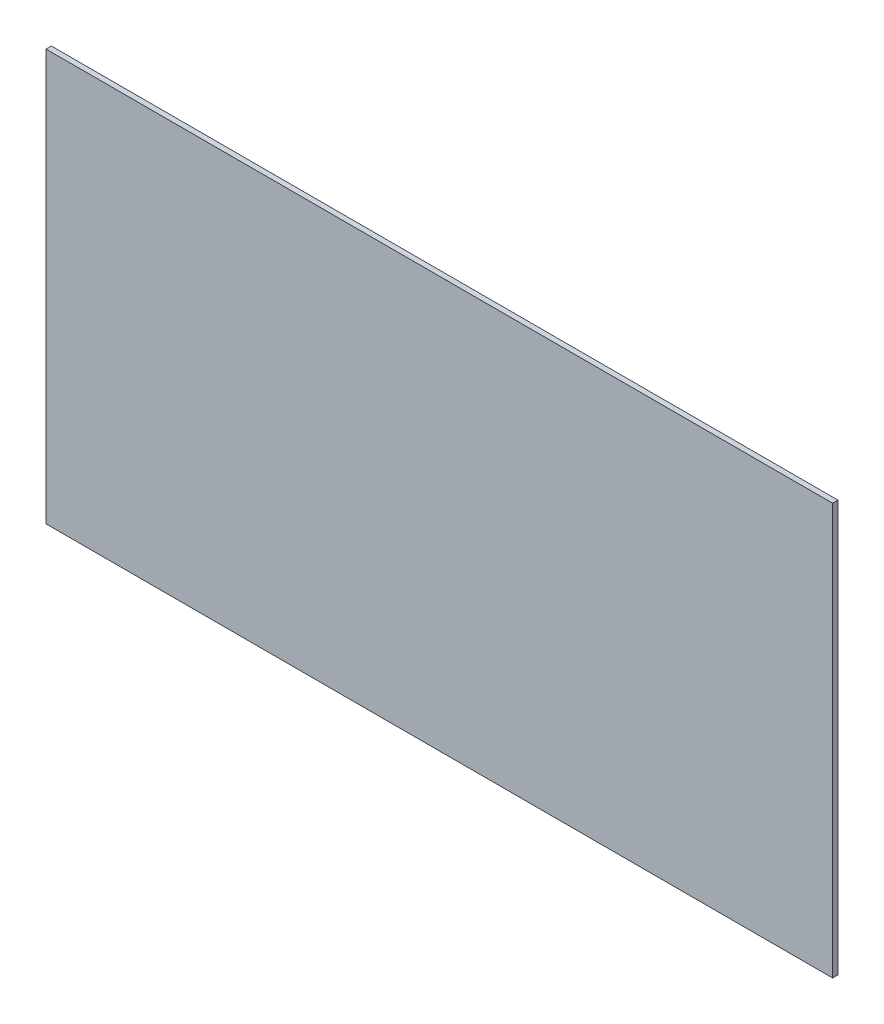
ISO-10303-21;
HEADER;
FILE_DESCRIPTION(('STEP AP214'),'2;1');
FILE_NAME('part.step','',(''),(''),'','','');
FILE_SCHEMA(('AUTOMOTIVE_DESIGN { 1 0 10303 214 1 1 1 1 }'));
ENDSEC;
DATA;
#1=APPLICATION_CONTEXT('core data for automotive mechanical design processes');
#2=APPLICATION_PROTOCOL_DEFINITION('international standard','automotive_design',2000,#1);
#3=PRODUCT_CONTEXT('',#1,'mechanical');
#4=PRODUCT('Part','Part','',(#3));
#5=PRODUCT_RELATED_PRODUCT_CATEGORY('part','',(#4));
#6=PRODUCT_DEFINITION_FORMATION('','',#4);
#7=PRODUCT_DEFINITION_CONTEXT('part definition',#1,'design');
#8=PRODUCT_DEFINITION('design','',#6,#7);
#9=PRODUCT_DEFINITION_SHAPE('','',#8);
#10=(LENGTH_UNIT() NAMED_UNIT(*) SI_UNIT(.MILLI.,.METRE.));
#11=(NAMED_UNIT(*) PLANE_ANGLE_UNIT() SI_UNIT($,.RADIAN.));
#12=(NAMED_UNIT(*) SI_UNIT($,.STERADIAN.) SOLID_ANGLE_UNIT());
#13=UNCERTAINTY_MEASURE_WITH_UNIT(LENGTH_MEASURE(1.E-05),#10,'distance_accuracy_value','');
#14=(GEOMETRIC_REPRESENTATION_CONTEXT(3) GLOBAL_UNCERTAINTY_ASSIGNED_CONTEXT((#13)) GLOBAL_UNIT_ASSIGNED_CONTEXT((#10,
#11,#12)) REPRESENTATION_CONTEXT('',''));
#15=CARTESIAN_POINT('',(0.,0.,0.));
#16=DIRECTION('',(0.,0.,1.));
#17=DIRECTION('',(1.,0.,0.));
#18=AXIS2_PLACEMENT_3D('',#15,#16,#17);
#19=CARTESIAN_POINT('',(220.,115.,3.));
#20=DIRECTION('',(-1.,0.,0.));
#21=DIRECTION('',(0.,-1.,0.));
#22=AXIS2_PLACEMENT_3D('',#19,#20,#21);
#23=PLANE('',#22);
#24=DIRECTION('',(0.,1.,0.));
#25=VECTOR('',#24,1.);
#26=CARTESIAN_POINT('',(220.,115.,0.));
#27=LINE('',#26,#25);
#28=CARTESIAN_POINT('',(220.,-115.,0.));
#29=VERTEX_POINT('',#28);
#30=CARTESIAN_POINT('',(220.,115.,0.));
#31=VERTEX_POINT('',#30);
#32=EDGE_CURVE('E96',#29,#31,#27,.T.);
#33=ORIENTED_EDGE('',*,*,#32,.T.);
#34=DIRECTION('',(0.,0.,-1.));
#35=VECTOR('',#34,1.);
#36=CARTESIAN_POINT('',(220.,115.,3.));
#37=LINE('',#36,#35);
#38=CARTESIAN_POINT('',(220.,115.,3.));
#39=VERTEX_POINT('',#38);
#40=EDGE_CURVE('E11',#39,#31,#37,.T.);
#41=ORIENTED_EDGE('',*,*,#40,.F.);
#42=DIRECTION('',(0.,1.,0.));
#43=VECTOR('',#42,1.);
#44=CARTESIAN_POINT('',(220.,115.,3.));
#45=LINE('',#44,#43);
#46=CARTESIAN_POINT('',(220.,-115.,3.));
#47=VERTEX_POINT('',#46);
#48=EDGE_CURVE('E84',#47,#39,#45,.T.);
#49=ORIENTED_EDGE('',*,*,#48,.F.);
#50=DIRECTION('',(0.,0.,-1.));
#51=VECTOR('',#50,1.);
#52=CARTESIAN_POINT('',(220.,-115.,3.));
#53=LINE('',#52,#51);
#54=EDGE_CURVE('E92',#47,#29,#53,.T.);
#55=ORIENTED_EDGE('',*,*,#54,.T.);
#56=EDGE_LOOP('',(#33,#41,#49,#55));
#57=FACE_BOUND('',#56,.T.);
#58=ADVANCED_FACE('F33',(#57),#23,.F.);
#59=CARTESIAN_POINT('',(-220.,115.,3.));
#60=DIRECTION('',(0.,-1.,0.));
#61=DIRECTION('',(0.,0.,-1.));
#62=AXIS2_PLACEMENT_3D('',#59,#60,#61);
#63=PLANE('',#62);
#64=DIRECTION('',(-1.,0.,0.));
#65=VECTOR('',#64,1.);
#66=CARTESIAN_POINT('',(-220.,115.,0.));
#67=LINE('',#66,#65);
#68=CARTESIAN_POINT('',(-220.,115.,0.));
#69=VERTEX_POINT('',#68);
#70=EDGE_CURVE('E88',#31,#69,#67,.T.);
#71=ORIENTED_EDGE('',*,*,#70,.T.);
#72=DIRECTION('',(0.,0.,-1.));
#73=VECTOR('',#72,1.);
#74=CARTESIAN_POINT('',(-220.,115.,3.));
#75=LINE('',#74,#73);
#76=CARTESIAN_POINT('',(-220.,115.,3.));
#77=VERTEX_POINT('',#76);
#78=EDGE_CURVE('E41',#77,#69,#75,.T.);
#79=ORIENTED_EDGE('',*,*,#78,.F.);
#80=DIRECTION('',(-1.,0.,0.));
#81=VECTOR('',#80,1.);
#82=CARTESIAN_POINT('',(-220.,115.,3.));
#83=LINE('',#82,#81);
#84=EDGE_CURVE('E79',#39,#77,#83,.T.);
#85=ORIENTED_EDGE('',*,*,#84,.F.);
#86=ORIENTED_EDGE('',*,*,#40,.T.);
#87=EDGE_LOOP('',(#71,#79,#85,#86));
#88=FACE_BOUND('',#87,.T.);
#89=ADVANCED_FACE('F87',(#88),#63,.F.);
#90=CARTESIAN_POINT('',(-220.,115.,3.));
#91=DIRECTION('',(1.,0.,0.));
#92=DIRECTION('',(0.,1.,0.));
#93=AXIS2_PLACEMENT_3D('',#90,#91,#92);
#94=PLANE('',#93);
#95=DIRECTION('',(0.,-1.,0.));
#96=VECTOR('',#95,1.);
#97=CARTESIAN_POINT('',(-220.,115.,0.));
#98=LINE('',#97,#96);
#99=CARTESIAN_POINT('',(-220.,-115.,0.));
#100=VERTEX_POINT('',#99);
#101=EDGE_CURVE('E66',#69,#100,#98,.T.);
#102=ORIENTED_EDGE('',*,*,#101,.T.);
#103=DIRECTION('',(0.,0.,-1.));
#104=VECTOR('',#103,1.);
#105=CARTESIAN_POINT('',(-220.,-115.,3.));
#106=LINE('',#105,#104);
#107=CARTESIAN_POINT('',(-220.,-115.,3.));
#108=VERTEX_POINT('',#107);
#109=EDGE_CURVE('E89',#108,#100,#106,.T.);
#110=ORIENTED_EDGE('',*,*,#109,.F.);
#111=DIRECTION('',(0.,-1.,0.));
#112=VECTOR('',#111,1.);
#113=CARTESIAN_POINT('',(-220.,115.,3.));
#114=LINE('',#113,#112);
#115=EDGE_CURVE('E82',#77,#108,#114,.T.);
#116=ORIENTED_EDGE('',*,*,#115,.F.);
#117=ORIENTED_EDGE('',*,*,#78,.T.);
#118=EDGE_LOOP('',(#102,#110,#116,#117));
#119=FACE_BOUND('',#118,.T.);
#120=ADVANCED_FACE('F90',(#119),#94,.F.);
#121=CARTESIAN_POINT('',(-220.,-115.,3.));
#122=DIRECTION('',(0.,1.,0.));
#123=DIRECTION('',(0.,0.,1.));
#124=AXIS2_PLACEMENT_3D('',#121,#122,#123);
#125=PLANE('',#124);
#126=DIRECTION('',(1.,0.,0.));
#127=VECTOR('',#126,1.);
#128=CARTESIAN_POINT('',(-220.,-115.,0.));
#129=LINE('',#128,#127);
#130=EDGE_CURVE('E72',#100,#29,#129,.T.);
#131=ORIENTED_EDGE('',*,*,#130,.T.);
#132=ORIENTED_EDGE('',*,*,#54,.F.);
#133=DIRECTION('',(1.,0.,0.));
#134=VECTOR('',#133,1.);
#135=CARTESIAN_POINT('',(-220.,-115.,3.));
#136=LINE('',#135,#134);
#137=EDGE_CURVE('E49',#108,#47,#136,.T.);
#138=ORIENTED_EDGE('',*,*,#137,.F.);
#139=ORIENTED_EDGE('',*,*,#109,.T.);
#140=EDGE_LOOP('',(#131,#132,#138,#139));
#141=FACE_BOUND('',#140,.T.);
#142=ADVANCED_FACE('F103',(#141),#125,.F.);
#143=CARTESIAN_POINT('',(0.,0.,3.));
#144=DIRECTION('',(0.,0.,1.));
#145=DIRECTION('',(1.,0.,0.));
#146=AXIS2_PLACEMENT_3D('',#143,#144,#145);
#147=PLANE('',#146);
#148=ORIENTED_EDGE('',*,*,#48,.T.);
#149=ORIENTED_EDGE('',*,*,#84,.T.);
#150=ORIENTED_EDGE('',*,*,#115,.T.);
#151=ORIENTED_EDGE('',*,*,#137,.T.);
#152=EDGE_LOOP('',(#148,#149,#150,#151));
#153=FACE_BOUND('',#152,.T.);
#154=ADVANCED_FACE('F80',(#153),#147,.T.);
#155=CARTESIAN_POINT('',(0.,0.,0.));
#156=DIRECTION('',(0.,0.,1.));
#157=DIRECTION('',(1.,0.,0.));
#158=AXIS2_PLACEMENT_3D('',#155,#156,#157);
#159=PLANE('',#158);
#160=ORIENTED_EDGE('',*,*,#32,.F.);
#161=ORIENTED_EDGE('',*,*,#130,.F.);
#162=ORIENTED_EDGE('',*,*,#101,.F.);
#163=ORIENTED_EDGE('',*,*,#70,.F.);
#164=EDGE_LOOP('',(#160,#161,#162,#163));
#165=FACE_BOUND('',#164,.T.);
#166=ADVANCED_FACE('F106',(#165),#159,.F.);
#167=CLOSED_SHELL('',(#58,#89,#120,#142,#154,#166));
#168=MANIFOLD_SOLID_BREP('B2',#167);
#169=ADVANCED_BREP_SHAPE_REPRESENTATION('',(#18,#168),#14);
#170=SHAPE_DEFINITION_REPRESENTATION(#9,#169);
ENDSEC;
END-ISO-10303-21;
